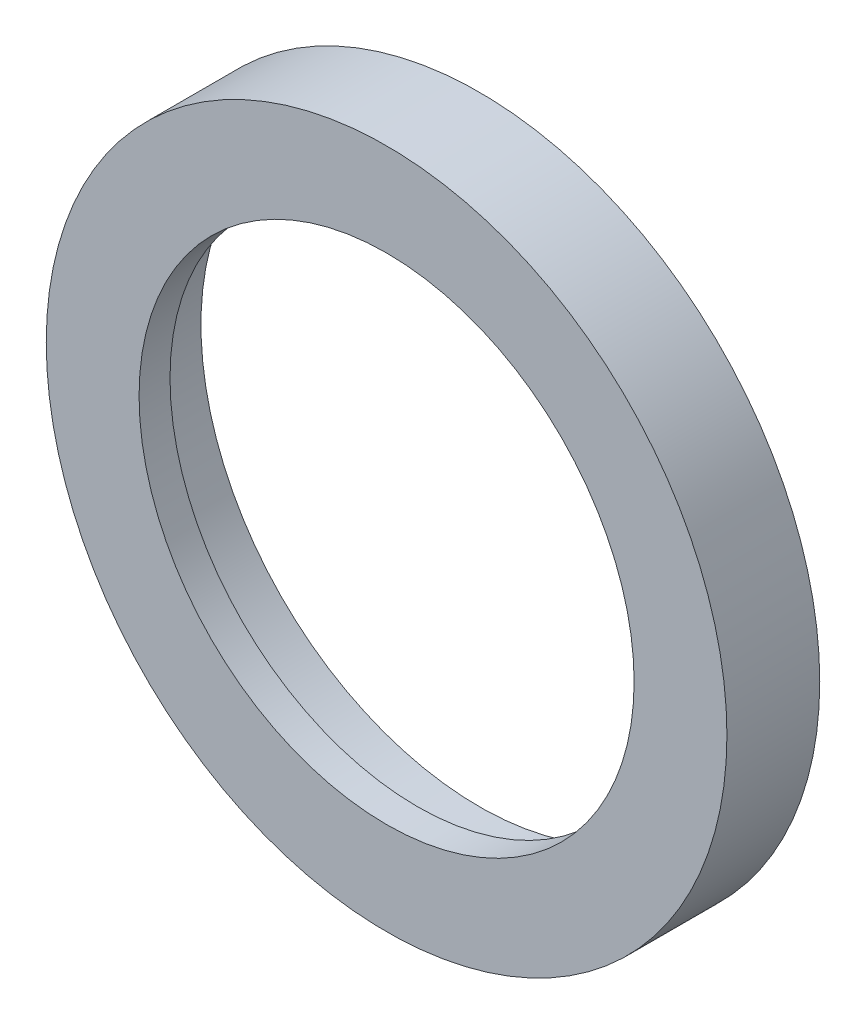
ISO-10303-21;
HEADER;
FILE_DESCRIPTION(('STEP AP214'),'2;1');
FILE_NAME('part.step','',(''),(''),'','','');
FILE_SCHEMA(('AUTOMOTIVE_DESIGN { 1 0 10303 214 1 1 1 1 }'));
ENDSEC;
DATA;
#1=APPLICATION_CONTEXT('core data for automotive mechanical design processes');
#2=APPLICATION_PROTOCOL_DEFINITION('international standard','automotive_design',2000,#1);
#3=PRODUCT_CONTEXT('',#1,'mechanical');
#4=PRODUCT('Part','Part','',(#3));
#5=PRODUCT_RELATED_PRODUCT_CATEGORY('part','',(#4));
#6=PRODUCT_DEFINITION_FORMATION('','',#4);
#7=PRODUCT_DEFINITION_CONTEXT('part definition',#1,'design');
#8=PRODUCT_DEFINITION('design','',#6,#7);
#9=PRODUCT_DEFINITION_SHAPE('','',#8);
#10=(LENGTH_UNIT() NAMED_UNIT(*) SI_UNIT(.MILLI.,.METRE.));
#11=(NAMED_UNIT(*) PLANE_ANGLE_UNIT() SI_UNIT($,.RADIAN.));
#12=(NAMED_UNIT(*) SI_UNIT($,.STERADIAN.) SOLID_ANGLE_UNIT());
#13=UNCERTAINTY_MEASURE_WITH_UNIT(LENGTH_MEASURE(1.E-05),#10,'distance_accuracy_value','');
#14=(GEOMETRIC_REPRESENTATION_CONTEXT(3) GLOBAL_UNCERTAINTY_ASSIGNED_CONTEXT((#13)) GLOBAL_UNIT_ASSIGNED_CONTEXT((#10,
#11,#12)) REPRESENTATION_CONTEXT('',''));
#15=CARTESIAN_POINT('',(0.,0.,0.));
#16=DIRECTION('',(0.,0.,1.));
#17=DIRECTION('',(1.,0.,0.));
#18=AXIS2_PLACEMENT_3D('',#15,#16,#17);
#19=CARTESIAN_POINT('',(0.,0.,0.));
#20=DIRECTION('',(0.,0.,1.));
#21=DIRECTION('',(1.,0.,0.));
#22=AXIS2_PLACEMENT_3D('',#19,#20,#21);
#23=CYLINDRICAL_SURFACE('',#22,22.);
#24=CARTESIAN_POINT('',(0.,0.,0.));
#25=DIRECTION('',(0.,0.,1.));
#26=DIRECTION('',(1.,0.,0.));
#27=AXIS2_PLACEMENT_3D('',#24,#25,#26);
#28=CIRCLE('',#27,22.);
#29=CARTESIAN_POINT('',(22.,0.,0.));
#30=VERTEX_POINT('',#29);
#31=EDGE_CURVE('E54',#30,#30,#28,.T.);
#32=ORIENTED_EDGE('',*,*,#31,.F.);
#33=EDGE_LOOP('',(#32));
#34=FACE_BOUND('',#33,.T.);
#35=CARTESIAN_POINT('',(0.,0.,-6.));
#36=DIRECTION('',(0.,0.,1.));
#37=DIRECTION('',(1.,0.,0.));
#38=AXIS2_PLACEMENT_3D('',#35,#36,#37);
#39=CIRCLE('',#38,22.);
#40=CARTESIAN_POINT('',(22.,0.,-6.));
#41=VERTEX_POINT('',#40);
#42=EDGE_CURVE('E10',#41,#41,#39,.T.);
#43=ORIENTED_EDGE('',*,*,#42,.T.);
#44=EDGE_LOOP('',(#43));
#45=FACE_BOUND('',#44,.T.);
#46=ADVANCED_FACE('F32',(#34,#45),#23,.T.);
#47=CARTESIAN_POINT('',(0.,22.,-6.));
#48=DIRECTION('',(0.,0.,1.));
#49=DIRECTION('',(1.,0.,0.));
#50=AXIS2_PLACEMENT_3D('',#47,#48,#49);
#51=PLANE('',#50);
#52=ORIENTED_EDGE('',*,*,#42,.F.);
#53=EDGE_LOOP('',(#52));
#54=FACE_BOUND('',#53,.T.);
#55=CARTESIAN_POINT('',(0.,0.,-6.));
#56=DIRECTION('',(0.,0.,1.));
#57=DIRECTION('',(1.,0.,0.));
#58=AXIS2_PLACEMENT_3D('',#55,#56,#57);
#59=CIRCLE('',#58,18.);
#60=CARTESIAN_POINT('',(18.,0.,-6.));
#61=VERTEX_POINT('',#60);
#62=EDGE_CURVE('E38',#61,#61,#59,.T.);
#63=ORIENTED_EDGE('',*,*,#62,.T.);
#64=EDGE_LOOP('',(#63));
#65=FACE_BOUND('',#64,.T.);
#66=ADVANCED_FACE('F61',(#54,#65),#51,.F.);
#67=CARTESIAN_POINT('',(0.,0.,0.));
#68=DIRECTION('',(0.,0.,1.));
#69=DIRECTION('',(1.,0.,0.));
#70=AXIS2_PLACEMENT_3D('',#67,#68,#69);
#71=CYLINDRICAL_SURFACE('',#70,18.);
#72=ORIENTED_EDGE('',*,*,#62,.F.);
#73=EDGE_LOOP('',(#72));
#74=FACE_BOUND('',#73,.T.);
#75=CARTESIAN_POINT('',(0.,0.,-2.));
#76=DIRECTION('',(0.,0.,1.));
#77=DIRECTION('',(1.,0.,0.));
#78=AXIS2_PLACEMENT_3D('',#75,#76,#77);
#79=CIRCLE('',#78,18.);
#80=CARTESIAN_POINT('',(18.,0.,-2.));
#81=VERTEX_POINT('',#80);
#82=EDGE_CURVE('E42',#81,#81,#79,.T.);
#83=ORIENTED_EDGE('',*,*,#82,.T.);
#84=EDGE_LOOP('',(#83));
#85=FACE_BOUND('',#84,.T.);
#86=ADVANCED_FACE('F65',(#74,#85),#71,.F.);
#87=CARTESIAN_POINT('',(0.,18.,-2.));
#88=DIRECTION('',(0.,0.,1.));
#89=DIRECTION('',(1.,0.,0.));
#90=AXIS2_PLACEMENT_3D('',#87,#88,#89);
#91=PLANE('',#90);
#92=ORIENTED_EDGE('',*,*,#82,.F.);
#93=EDGE_LOOP('',(#92));
#94=FACE_BOUND('',#93,.T.);
#95=CARTESIAN_POINT('',(0.,0.,-2.));
#96=DIRECTION('',(0.,0.,1.));
#97=DIRECTION('',(1.,0.,0.));
#98=AXIS2_PLACEMENT_3D('',#95,#96,#97);
#99=CIRCLE('',#98,16.);
#100=CARTESIAN_POINT('',(16.,0.,-2.));
#101=VERTEX_POINT('',#100);
#102=EDGE_CURVE('E46',#101,#101,#99,.T.);
#103=ORIENTED_EDGE('',*,*,#102,.T.);
#104=EDGE_LOOP('',(#103));
#105=FACE_BOUND('',#104,.T.);
#106=ADVANCED_FACE('F70',(#94,#105),#91,.F.);
#107=CARTESIAN_POINT('',(0.,0.,0.));
#108=DIRECTION('',(0.,0.,1.));
#109=DIRECTION('',(1.,0.,0.));
#110=AXIS2_PLACEMENT_3D('',#107,#108,#109);
#111=CYLINDRICAL_SURFACE('',#110,16.);
#112=ORIENTED_EDGE('',*,*,#102,.F.);
#113=EDGE_LOOP('',(#112));
#114=FACE_BOUND('',#113,.T.);
#115=CARTESIAN_POINT('',(0.,0.,0.));
#116=DIRECTION('',(0.,0.,1.));
#117=DIRECTION('',(1.,0.,0.));
#118=AXIS2_PLACEMENT_3D('',#115,#116,#117);
#119=CIRCLE('',#118,16.);
#120=CARTESIAN_POINT('',(16.,0.,0.));
#121=VERTEX_POINT('',#120);
#122=EDGE_CURVE('E51',#121,#121,#119,.T.);
#123=ORIENTED_EDGE('',*,*,#122,.T.);
#124=EDGE_LOOP('',(#123));
#125=FACE_BOUND('',#124,.T.);
#126=ADVANCED_FACE('F76',(#114,#125),#111,.F.);
#127=CARTESIAN_POINT('',(0.,16.,0.));
#128=DIRECTION('',(0.,0.,-1.));
#129=DIRECTION('',(-1.,0.,0.));
#130=AXIS2_PLACEMENT_3D('',#127,#128,#129);
#131=PLANE('',#130);
#132=ORIENTED_EDGE('',*,*,#122,.F.);
#133=EDGE_LOOP('',(#132));
#134=FACE_BOUND('',#133,.T.);
#135=ORIENTED_EDGE('',*,*,#31,.T.);
#136=EDGE_LOOP('',(#135));
#137=FACE_BOUND('',#136,.T.);
#138=ADVANCED_FACE('F58',(#134,#137),#131,.F.);
#139=CLOSED_SHELL('',(#46,#66,#86,#106,#126,#138));
#140=MANIFOLD_SOLID_BREP('B2',#139);
#141=ADVANCED_BREP_SHAPE_REPRESENTATION('',(#18,#140),#14);
#142=SHAPE_DEFINITION_REPRESENTATION(#9,#141);
ENDSEC;
END-ISO-10303-21;
